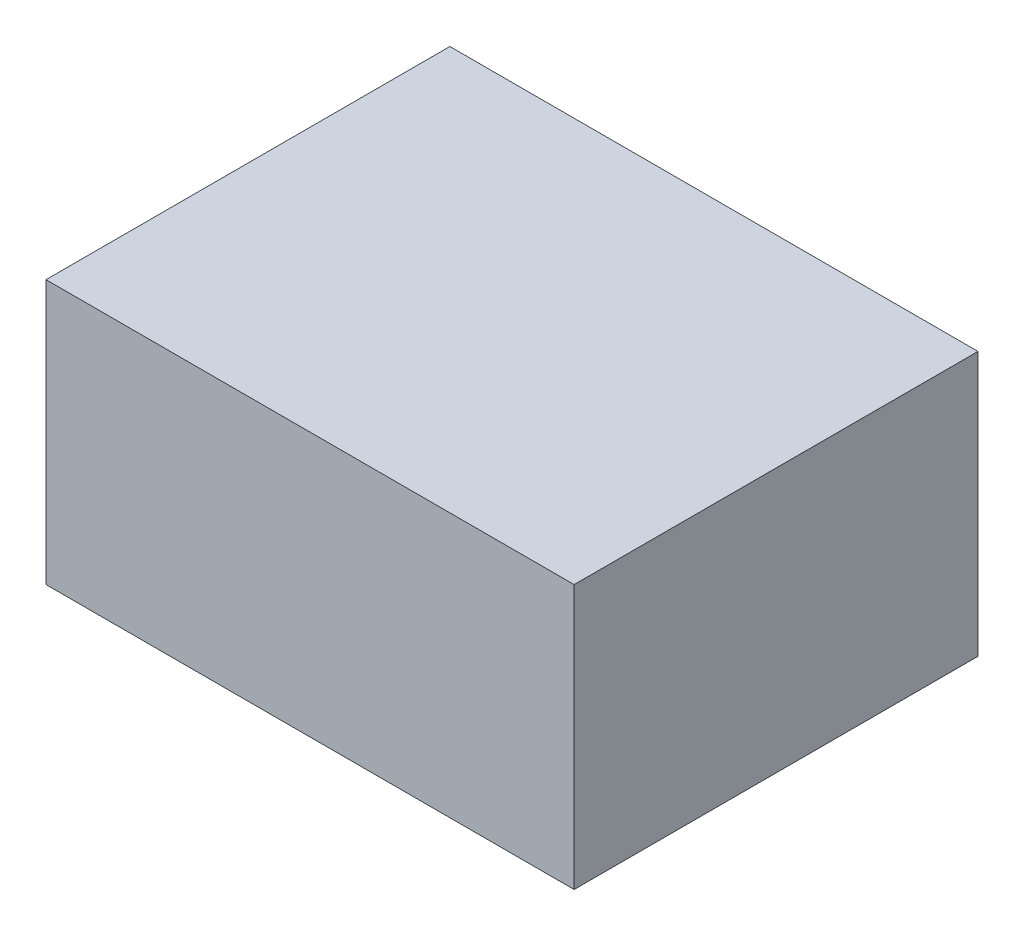
ISO-10303-21;
HEADER;
FILE_DESCRIPTION(('STEP AP214'),'2;1');
FILE_NAME('part.step','',(''),(''),'','','');
FILE_SCHEMA(('AUTOMOTIVE_DESIGN { 1 0 10303 214 1 1 1 1 }'));
ENDSEC;
DATA;
#1=APPLICATION_CONTEXT('core data for automotive mechanical design processes');
#2=APPLICATION_PROTOCOL_DEFINITION('international standard','automotive_design',2000,#1);
#3=PRODUCT_CONTEXT('',#1,'mechanical');
#4=PRODUCT('Part','Part','',(#3));
#5=PRODUCT_RELATED_PRODUCT_CATEGORY('part','',(#4));
#6=PRODUCT_DEFINITION_FORMATION('','',#4);
#7=PRODUCT_DEFINITION_CONTEXT('part definition',#1,'design');
#8=PRODUCT_DEFINITION('design','',#6,#7);
#9=PRODUCT_DEFINITION_SHAPE('','',#8);
#10=(LENGTH_UNIT() NAMED_UNIT(*) SI_UNIT(.MILLI.,.METRE.));
#11=(NAMED_UNIT(*) PLANE_ANGLE_UNIT() SI_UNIT($,.RADIAN.));
#12=(NAMED_UNIT(*) SI_UNIT($,.STERADIAN.) SOLID_ANGLE_UNIT());
#13=UNCERTAINTY_MEASURE_WITH_UNIT(LENGTH_MEASURE(1.E-05),#10,'distance_accuracy_value','');
#14=(GEOMETRIC_REPRESENTATION_CONTEXT(3) GLOBAL_UNCERTAINTY_ASSIGNED_CONTEXT((#13)) GLOBAL_UNIT_ASSIGNED_CONTEXT((#10,
#11,#12)) REPRESENTATION_CONTEXT('',''));
#15=CARTESIAN_POINT('',(0.,0.,0.));
#16=DIRECTION('',(0.,0.,1.));
#17=DIRECTION('',(1.,0.,0.));
#18=AXIS2_PLACEMENT_3D('',#15,#16,#17);
#19=CARTESIAN_POINT('',(0.17,0.17,0.13));
#20=DIRECTION('',(-1.,0.,0.));
#21=DIRECTION('',(0.,0.,1.));
#22=AXIS2_PLACEMENT_3D('',#19,#20,#21);
#23=PLANE('',#22);
#24=DIRECTION('',(0.,0.,-1.));
#25=VECTOR('',#24,1.);
#26=CARTESIAN_POINT('',(0.17,0.,0.13));
#27=LINE('',#26,#25);
#28=CARTESIAN_POINT('',(0.17,0.,0.13));
#29=VERTEX_POINT('',#28);
#30=CARTESIAN_POINT('',(0.17,0.,-0.13));
#31=VERTEX_POINT('',#30);
#32=EDGE_CURVE('E107',#29,#31,#27,.T.);
#33=ORIENTED_EDGE('',*,*,#32,.T.);
#34=DIRECTION('',(0.,-1.,0.));
#35=VECTOR('',#34,1.);
#36=CARTESIAN_POINT('',(0.17,0.17,-0.13));
#37=LINE('',#36,#35);
#38=CARTESIAN_POINT('',(0.17,0.17,-0.13));
#39=VERTEX_POINT('',#38);
#40=EDGE_CURVE('E11',#39,#31,#37,.T.);
#41=ORIENTED_EDGE('',*,*,#40,.F.);
#42=DIRECTION('',(0.,0.,-1.));
#43=VECTOR('',#42,1.);
#44=CARTESIAN_POINT('',(0.17,0.17,0.13));
#45=LINE('',#44,#43);
#46=CARTESIAN_POINT('',(0.17,0.17,0.13));
#47=VERTEX_POINT('',#46);
#48=EDGE_CURVE('E91',#47,#39,#45,.T.);
#49=ORIENTED_EDGE('',*,*,#48,.F.);
#50=DIRECTION('',(0.,-1.,0.));
#51=VECTOR('',#50,1.);
#52=CARTESIAN_POINT('',(0.17,0.17,0.13));
#53=LINE('',#52,#51);
#54=EDGE_CURVE('E103',#47,#29,#53,.T.);
#55=ORIENTED_EDGE('',*,*,#54,.T.);
#56=EDGE_LOOP('',(#33,#41,#49,#55));
#57=FACE_BOUND('',#56,.T.);
#58=ADVANCED_FACE('F39',(#57),#23,.F.);
#59=CARTESIAN_POINT('',(-0.17,0.17,-0.13));
#60=DIRECTION('',(0.,0.,1.));
#61=DIRECTION('',(1.,0.,0.));
#62=AXIS2_PLACEMENT_3D('',#59,#60,#61);
#63=PLANE('',#62);
#64=DIRECTION('',(-1.,0.,0.));
#65=VECTOR('',#64,1.);
#66=CARTESIAN_POINT('',(-0.17,0.,-0.13));
#67=LINE('',#66,#65);
#68=CARTESIAN_POINT('',(-0.17,0.,-0.13));
#69=VERTEX_POINT('',#68);
#70=EDGE_CURVE('E96',#31,#69,#67,.T.);
#71=ORIENTED_EDGE('',*,*,#70,.T.);
#72=DIRECTION('',(0.,-1.,0.));
#73=VECTOR('',#72,1.);
#74=CARTESIAN_POINT('',(-0.17,0.17,-0.13));
#75=LINE('',#74,#73);
#76=CARTESIAN_POINT('',(-0.17,0.17,-0.13));
#77=VERTEX_POINT('',#76);
#78=EDGE_CURVE('E48',#77,#69,#75,.T.);
#79=ORIENTED_EDGE('',*,*,#78,.F.);
#80=DIRECTION('',(-1.,0.,0.));
#81=VECTOR('',#80,1.);
#82=CARTESIAN_POINT('',(-0.17,0.17,-0.13));
#83=LINE('',#82,#81);
#84=EDGE_CURVE('E86',#39,#77,#83,.T.);
#85=ORIENTED_EDGE('',*,*,#84,.F.);
#86=ORIENTED_EDGE('',*,*,#40,.T.);
#87=EDGE_LOOP('',(#71,#79,#85,#86));
#88=FACE_BOUND('',#87,.T.);
#89=ADVANCED_FACE('F95',(#88),#63,.F.);
#90=CARTESIAN_POINT('',(-0.17,0.17,0.13));
#91=DIRECTION('',(1.,0.,0.));
#92=DIRECTION('',(0.,0.,-1.));
#93=AXIS2_PLACEMENT_3D('',#90,#91,#92);
#94=PLANE('',#93);
#95=DIRECTION('',(0.,0.,1.));
#96=VECTOR('',#95,1.);
#97=CARTESIAN_POINT('',(-0.17,0.,0.13));
#98=LINE('',#97,#96);
#99=CARTESIAN_POINT('',(-0.17,0.,0.13));
#100=VERTEX_POINT('',#99);
#101=EDGE_CURVE('E73',#69,#100,#98,.T.);
#102=ORIENTED_EDGE('',*,*,#101,.T.);
#103=DIRECTION('',(0.,-1.,0.));
#104=VECTOR('',#103,1.);
#105=CARTESIAN_POINT('',(-0.17,0.17,0.13));
#106=LINE('',#105,#104);
#107=CARTESIAN_POINT('',(-0.17,0.17,0.13));
#108=VERTEX_POINT('',#107);
#109=EDGE_CURVE('E98',#108,#100,#106,.T.);
#110=ORIENTED_EDGE('',*,*,#109,.F.);
#111=DIRECTION('',(0.,0.,1.));
#112=VECTOR('',#111,1.);
#113=CARTESIAN_POINT('',(-0.17,0.17,0.13));
#114=LINE('',#113,#112);
#115=EDGE_CURVE('E89',#77,#108,#114,.T.);
#116=ORIENTED_EDGE('',*,*,#115,.F.);
#117=ORIENTED_EDGE('',*,*,#78,.T.);
#118=EDGE_LOOP('',(#102,#110,#116,#117));
#119=FACE_BOUND('',#118,.T.);
#120=ADVANCED_FACE('F99',(#119),#94,.F.);
#121=CARTESIAN_POINT('',(-0.17,0.17,0.13));
#122=DIRECTION('',(0.,0.,-1.));
#123=DIRECTION('',(-1.,0.,0.));
#124=AXIS2_PLACEMENT_3D('',#121,#122,#123);
#125=PLANE('',#124);
#126=DIRECTION('',(1.,0.,0.));
#127=VECTOR('',#126,1.);
#128=CARTESIAN_POINT('',(-0.17,0.,0.13));
#129=LINE('',#128,#127);
#130=EDGE_CURVE('E79',#100,#29,#129,.T.);
#131=ORIENTED_EDGE('',*,*,#130,.T.);
#132=ORIENTED_EDGE('',*,*,#54,.F.);
#133=DIRECTION('',(1.,0.,0.));
#134=VECTOR('',#133,1.);
#135=CARTESIAN_POINT('',(-0.17,0.17,0.13));
#136=LINE('',#135,#134);
#137=EDGE_CURVE('E56',#108,#47,#136,.T.);
#138=ORIENTED_EDGE('',*,*,#137,.F.);
#139=ORIENTED_EDGE('',*,*,#109,.T.);
#140=EDGE_LOOP('',(#131,#132,#138,#139));
#141=FACE_BOUND('',#140,.T.);
#142=ADVANCED_FACE('F120',(#141),#125,.F.);
#143=CARTESIAN_POINT('',(0.,0.17,0.));
#144=DIRECTION('',(0.,-1.,0.));
#145=DIRECTION('',(0.,0.,-1.));
#146=AXIS2_PLACEMENT_3D('',#143,#144,#145);
#147=PLANE('',#146);
#148=ORIENTED_EDGE('',*,*,#48,.T.);
#149=ORIENTED_EDGE('',*,*,#84,.T.);
#150=ORIENTED_EDGE('',*,*,#115,.T.);
#151=ORIENTED_EDGE('',*,*,#137,.T.);
#152=EDGE_LOOP('',(#148,#149,#150,#151));
#153=FACE_BOUND('',#152,.T.);
#154=ADVANCED_FACE('F87',(#153),#147,.F.);
#155=CARTESIAN_POINT('',(0.,0.,0.));
#156=DIRECTION('',(0.,-1.,0.));
#157=DIRECTION('',(0.,0.,-1.));
#158=AXIS2_PLACEMENT_3D('',#155,#156,#157);
#159=PLANE('',#158);
#160=ORIENTED_EDGE('',*,*,#32,.F.);
#161=ORIENTED_EDGE('',*,*,#130,.F.);
#162=ORIENTED_EDGE('',*,*,#101,.F.);
#163=ORIENTED_EDGE('',*,*,#70,.F.);
#164=EDGE_LOOP('',(#160,#161,#162,#163));
#165=FACE_BOUND('',#164,.T.);
#166=ADVANCED_FACE('F123',(#165),#159,.T.);
#167=CLOSED_SHELL('',(#58,#89,#120,#142,#154,#166));
#168=MANIFOLD_SOLID_BREP('B2',#167);
#169=ADVANCED_BREP_SHAPE_REPRESENTATION('',(#18,#168),#14);
#170=SHAPE_DEFINITION_REPRESENTATION(#9,#169);
ENDSEC;
END-ISO-10303-21;
